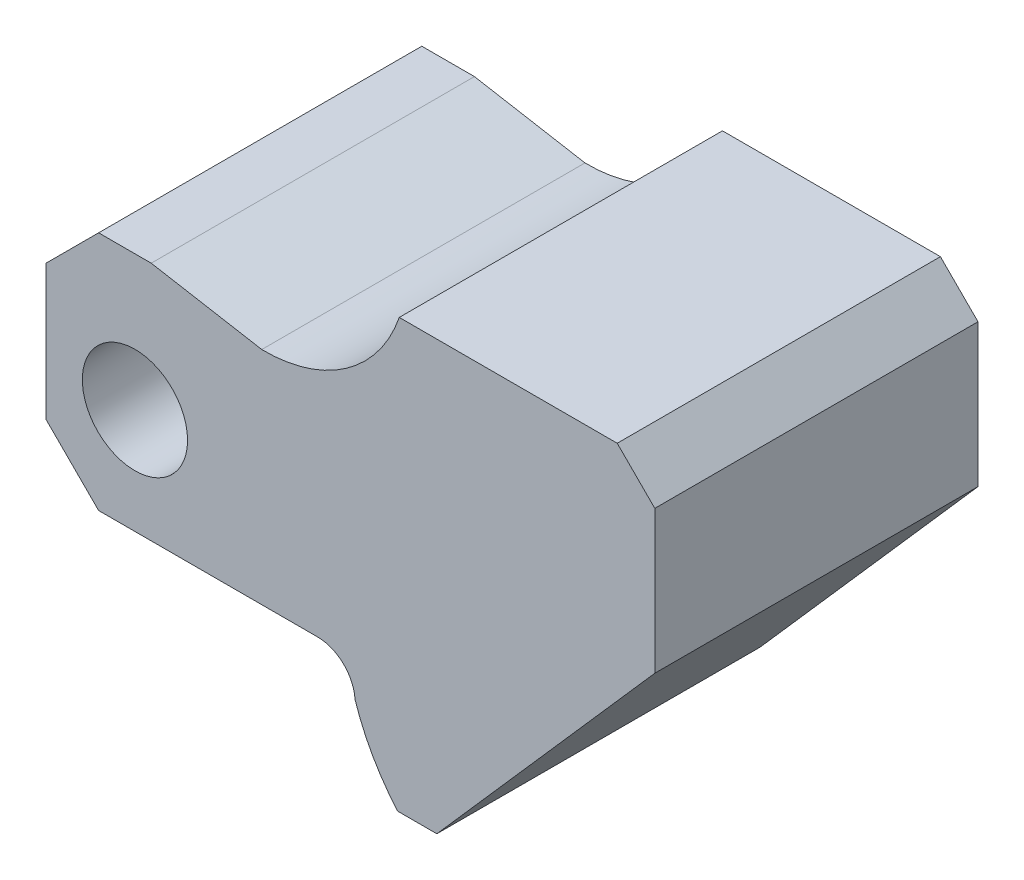
ISO-10303-21;
HEADER;
FILE_DESCRIPTION(('STEP AP214'),'2;1');
FILE_NAME('part.step','',(''),(''),'','','');
FILE_SCHEMA(('AUTOMOTIVE_DESIGN { 1 0 10303 214 1 1 1 1 }'));
ENDSEC;
DATA;
#1=APPLICATION_CONTEXT('core data for automotive mechanical design processes');
#2=APPLICATION_PROTOCOL_DEFINITION('international standard','automotive_design',2000,#1);
#3=PRODUCT_CONTEXT('',#1,'mechanical');
#4=PRODUCT('Part','Part','',(#3));
#5=PRODUCT_RELATED_PRODUCT_CATEGORY('part','',(#4));
#6=PRODUCT_DEFINITION_FORMATION('','',#4);
#7=PRODUCT_DEFINITION_CONTEXT('part definition',#1,'design');
#8=PRODUCT_DEFINITION('design','',#6,#7);
#9=PRODUCT_DEFINITION_SHAPE('','',#8);
#10=(LENGTH_UNIT() NAMED_UNIT(*) SI_UNIT(.MILLI.,.METRE.));
#11=(NAMED_UNIT(*) PLANE_ANGLE_UNIT() SI_UNIT($,.RADIAN.));
#12=(NAMED_UNIT(*) SI_UNIT($,.STERADIAN.) SOLID_ANGLE_UNIT());
#13=UNCERTAINTY_MEASURE_WITH_UNIT(LENGTH_MEASURE(1.E-05),#10,'distance_accuracy_value','');
#14=(GEOMETRIC_REPRESENTATION_CONTEXT(3) GLOBAL_UNCERTAINTY_ASSIGNED_CONTEXT((#13)) GLOBAL_UNIT_ASSIGNED_CONTEXT((#10,
#11,#12)) REPRESENTATION_CONTEXT('',''));
#15=CARTESIAN_POINT('',(0.,0.,0.));
#16=DIRECTION('',(0.,0.,1.));
#17=DIRECTION('',(1.,0.,0.));
#18=AXIS2_PLACEMENT_3D('',#15,#16,#17);
#19=CARTESIAN_POINT('',(24.0554988623099,7.3340290025084,43.));
#20=DIRECTION('',(0.707106781186548,0.707106781186547,0.));
#21=DIRECTION('',(-0.707106781186547,0.707106781186548,0.));
#22=AXIS2_PLACEMENT_3D('',#19,#20,#21);
#23=PLANE('',#22);
#24=DIRECTION('',(0.707106781186547,-0.707106781186548,0.));
#25=VECTOR('',#24,1.);
#26=CARTESIAN_POINT('',(24.0554988623099,7.3340290025084,0.));
#27=LINE('',#26,#25);
#28=CARTESIAN_POINT('',(24.0554988623099,7.3340290025084,0.));
#29=VERTEX_POINT('',#28);
#30=CARTESIAN_POINT('',(31.0554988623099,0.334029002508402,0.));
#31=VERTEX_POINT('',#30);
#32=EDGE_CURVE('E169',#29,#31,#27,.T.);
#33=ORIENTED_EDGE('',*,*,#32,.T.);
#34=DIRECTION('',(0.,0.,-1.));
#35=VECTOR('',#34,1.);
#36=CARTESIAN_POINT('',(31.0554988623099,0.334029002508402,43.));
#37=LINE('',#36,#35);
#38=CARTESIAN_POINT('',(31.0554988623099,0.334029002508402,43.));
#39=VERTEX_POINT('',#38);
#40=EDGE_CURVE('E11',#39,#31,#37,.T.);
#41=ORIENTED_EDGE('',*,*,#40,.F.);
#42=DIRECTION('',(0.707106781186547,-0.707106781186548,0.));
#43=VECTOR('',#42,1.);
#44=CARTESIAN_POINT('',(24.0554988623099,7.3340290025084,43.));
#45=LINE('',#44,#43);
#46=CARTESIAN_POINT('',(24.0554988623099,7.3340290025084,43.));
#47=VERTEX_POINT('',#46);
#48=EDGE_CURVE('E196',#47,#39,#45,.T.);
#49=ORIENTED_EDGE('',*,*,#48,.F.);
#50=DIRECTION('',(0.,0.,-1.));
#51=VECTOR('',#50,1.);
#52=CARTESIAN_POINT('',(24.0554988623099,7.3340290025084,43.));
#53=LINE('',#52,#51);
#54=EDGE_CURVE('E165',#47,#29,#53,.T.);
#55=ORIENTED_EDGE('',*,*,#54,.T.);
#56=EDGE_LOOP('',(#33,#41,#49,#55));
#57=FACE_BOUND('',#56,.T.);
#58=ADVANCED_FACE('F37',(#57),#23,.F.);
#59=CARTESIAN_POINT('',(31.0554988623099,0.334029002508402,43.));
#60=DIRECTION('',(0.,1.,0.));
#61=DIRECTION('',(0.,0.,1.));
#62=AXIS2_PLACEMENT_3D('',#59,#60,#61);
#63=PLANE('',#62);
#64=DIRECTION('',(1.,0.,0.));
#65=VECTOR('',#64,1.);
#66=CARTESIAN_POINT('',(31.0554988623099,0.334029002508402,0.));
#67=LINE('',#66,#65);
#68=CARTESIAN_POINT('',(60.1798444267935,0.334029002508401,0.));
#69=VERTEX_POINT('',#68);
#70=EDGE_CURVE('E172',#31,#69,#67,.T.);
#71=ORIENTED_EDGE('',*,*,#70,.T.);
#72=DIRECTION('',(0.,0.,-1.));
#73=VECTOR('',#72,1.);
#74=CARTESIAN_POINT('',(60.1798444267935,0.334029002508401,43.));
#75=LINE('',#74,#73);
#76=CARTESIAN_POINT('',(60.1798444267935,0.334029002508401,43.));
#77=VERTEX_POINT('',#76);
#78=EDGE_CURVE('E45',#77,#69,#75,.T.);
#79=ORIENTED_EDGE('',*,*,#78,.F.);
#80=DIRECTION('',(1.,0.,0.));
#81=VECTOR('',#80,1.);
#82=CARTESIAN_POINT('',(31.0554988623099,0.334029002508402,43.));
#83=LINE('',#82,#81);
#84=EDGE_CURVE('E114',#39,#77,#83,.T.);
#85=ORIENTED_EDGE('',*,*,#84,.F.);
#86=ORIENTED_EDGE('',*,*,#40,.T.);
#87=EDGE_LOOP('',(#71,#79,#85,#86));
#88=FACE_BOUND('',#87,.T.);
#89=ADVANCED_FACE('F285',(#88),#63,.F.);
#90=CARTESIAN_POINT('',(60.1798444267935,-4.6659709974916,43.));
#91=DIRECTION('',(0.,0.,-1.));
#92=DIRECTION('',(-1.,0.,0.));
#93=AXIS2_PLACEMENT_3D('',#90,#91,#92);
#94=CYLINDRICAL_SURFACE('',#93,5.);
#95=CARTESIAN_POINT('',(60.1798444267935,-4.6659709974916,0.));
#96=DIRECTION('',(0.,0.,-1.));
#97=DIRECTION('',(-1.,0.,0.));
#98=AXIS2_PLACEMENT_3D('',#95,#96,#97);
#99=CIRCLE('',#98,5.);
#100=CARTESIAN_POINT('',(65.1713210884327,-4.37414787244652,0.));
#101=VERTEX_POINT('',#100);
#102=EDGE_CURVE('E175',#69,#101,#99,.T.);
#103=ORIENTED_EDGE('',*,*,#102,.T.);
#104=DIRECTION('',(0.,0.,-1.));
#105=VECTOR('',#104,1.);
#106=CARTESIAN_POINT('',(65.1713210884327,-4.37414787244652,43.));
#107=LINE('',#106,#105);
#108=CARTESIAN_POINT('',(65.1713210884327,-4.37414787244652,43.));
#109=VERTEX_POINT('',#108);
#110=EDGE_CURVE('E221',#109,#101,#107,.T.);
#111=ORIENTED_EDGE('',*,*,#110,.F.);
#112=CARTESIAN_POINT('',(60.1798444267935,-4.6659709974916,43.));
#113=DIRECTION('',(0.,0.,-1.));
#114=DIRECTION('',(-1.,0.,0.));
#115=AXIS2_PLACEMENT_3D('',#112,#113,#114);
#116=CIRCLE('',#115,5.);
#117=EDGE_CURVE('E229',#77,#109,#116,.T.);
#118=ORIENTED_EDGE('',*,*,#117,.F.);
#119=ORIENTED_EDGE('',*,*,#78,.T.);
#120=EDGE_LOOP('',(#103,#111,#118,#119));
#121=FACE_BOUND('',#120,.T.);
#122=ADVANCED_FACE('F227',(#121),#94,.F.);
#123=CARTESIAN_POINT('',(92.7524685592796,4.58577981651377,43.));
#124=DIRECTION('',(0.,0.,-1.));
#125=DIRECTION('',(-1.,0.,0.));
#126=AXIS2_PLACEMENT_3D('',#123,#124,#125);
#127=CYLINDRICAL_SURFACE('',#126,29.);
#128=CARTESIAN_POINT('',(92.7524685592796,4.58577981651377,0.));
#129=DIRECTION('',(0.,0.,1.));
#130=DIRECTION('',(1.,0.,0.));
#131=AXIS2_PLACEMENT_3D('',#128,#129,#130);
#132=CIRCLE('',#131,29.);
#133=CARTESIAN_POINT('',(70.8435662590729,-14.4142201834862,0.));
#134=VERTEX_POINT('',#133);
#135=EDGE_CURVE('E177',#101,#134,#132,.T.);
#136=ORIENTED_EDGE('',*,*,#135,.T.);
#137=DIRECTION('',(0.,0.,-1.));
#138=VECTOR('',#137,1.);
#139=CARTESIAN_POINT('',(70.8435662590729,-14.4142201834862,43.));
#140=LINE('',#139,#138);
#141=CARTESIAN_POINT('',(70.8435662590729,-14.4142201834862,43.));
#142=VERTEX_POINT('',#141);
#143=EDGE_CURVE('E218',#142,#134,#140,.T.);
#144=ORIENTED_EDGE('',*,*,#143,.F.);
#145=CARTESIAN_POINT('',(92.7524685592796,4.58577981651377,43.));
#146=DIRECTION('',(0.,0.,1.));
#147=DIRECTION('',(1.,0.,0.));
#148=AXIS2_PLACEMENT_3D('',#145,#146,#147);
#149=CIRCLE('',#148,29.);
#150=EDGE_CURVE('E247',#109,#142,#149,.T.);
#151=ORIENTED_EDGE('',*,*,#150,.F.);
#152=ORIENTED_EDGE('',*,*,#110,.T.);
#153=EDGE_LOOP('',(#136,#144,#151,#152));
#154=FACE_BOUND('',#153,.T.);
#155=ADVANCED_FACE('F238',(#154),#127,.T.);
#156=CARTESIAN_POINT('',(76.0554988623099,-14.4142201834862,43.));
#157=DIRECTION('',(0.,1.,0.));
#158=DIRECTION('',(0.,0.,1.));
#159=AXIS2_PLACEMENT_3D('',#156,#157,#158);
#160=PLANE('',#159);
#161=DIRECTION('',(1.,0.,0.));
#162=VECTOR('',#161,1.);
#163=CARTESIAN_POINT('',(76.0554988623099,-14.4142201834862,0.));
#164=LINE('',#163,#162);
#165=CARTESIAN_POINT('',(76.0554988623099,-14.4142201834862,0.));
#166=VERTEX_POINT('',#165);
#167=EDGE_CURVE('E179',#134,#166,#164,.T.);
#168=ORIENTED_EDGE('',*,*,#167,.T.);
#169=DIRECTION('',(0.,0.,-1.));
#170=VECTOR('',#169,1.);
#171=CARTESIAN_POINT('',(76.0554988623099,-14.4142201834862,43.));
#172=LINE('',#171,#170);
#173=CARTESIAN_POINT('',(76.0554988623099,-14.4142201834862,43.));
#174=VERTEX_POINT('',#173);
#175=EDGE_CURVE('E215',#174,#166,#172,.T.);
#176=ORIENTED_EDGE('',*,*,#175,.F.);
#177=DIRECTION('',(1.,0.,0.));
#178=VECTOR('',#177,1.);
#179=CARTESIAN_POINT('',(76.0554988623099,-14.4142201834862,43.));
#180=LINE('',#179,#178);
#181=EDGE_CURVE('E244',#142,#174,#180,.T.);
#182=ORIENTED_EDGE('',*,*,#181,.F.);
#183=ORIENTED_EDGE('',*,*,#143,.T.);
#184=EDGE_LOOP('',(#168,#176,#182,#183));
#185=FACE_BOUND('',#184,.T.);
#186=ADVANCED_FACE('F242',(#185),#160,.F.);
#187=CARTESIAN_POINT('',(105.05549886231,18.5857798165138,43.));
#188=DIRECTION('',(-0.751164898449876,0.660114607728678,0.));
#189=DIRECTION('',(-0.660114607728678,-0.751164898449877,0.));
#190=AXIS2_PLACEMENT_3D('',#187,#188,#189);
#191=PLANE('',#190);
#192=DIRECTION('',(0.660114607728678,0.751164898449876,0.));
#193=VECTOR('',#192,1.);
#194=CARTESIAN_POINT('',(105.05549886231,18.5857798165138,0.));
#195=LINE('',#194,#193);
#196=CARTESIAN_POINT('',(105.05549886231,18.5857798165138,0.));
#197=VERTEX_POINT('',#196);
#198=EDGE_CURVE('E181',#166,#197,#195,.T.);
#199=ORIENTED_EDGE('',*,*,#198,.T.);
#200=DIRECTION('',(0.,0.,-1.));
#201=VECTOR('',#200,1.);
#202=CARTESIAN_POINT('',(105.05549886231,18.5857798165138,43.));
#203=LINE('',#202,#201);
#204=CARTESIAN_POINT('',(105.05549886231,18.5857798165138,43.));
#205=VERTEX_POINT('',#204);
#206=EDGE_CURVE('E212',#205,#197,#203,.T.);
#207=ORIENTED_EDGE('',*,*,#206,.F.);
#208=DIRECTION('',(0.660114607728678,0.751164898449876,0.));
#209=VECTOR('',#208,1.);
#210=CARTESIAN_POINT('',(105.05549886231,18.5857798165138,43.));
#211=LINE('',#210,#209);
#212=EDGE_CURVE('E246',#174,#205,#211,.T.);
#213=ORIENTED_EDGE('',*,*,#212,.F.);
#214=ORIENTED_EDGE('',*,*,#175,.T.);
#215=EDGE_LOOP('',(#199,#207,#213,#214));
#216=FACE_BOUND('',#215,.T.);
#217=ADVANCED_FACE('F298',(#216),#191,.F.);
#218=CARTESIAN_POINT('',(105.05549886231,37.5857798165138,43.));
#219=DIRECTION('',(-1.,0.,0.));
#220=DIRECTION('',(0.,-1.,0.));
#221=AXIS2_PLACEMENT_3D('',#218,#219,#220);
#222=PLANE('',#221);
#223=DIRECTION('',(0.,1.,0.));
#224=VECTOR('',#223,1.);
#225=CARTESIAN_POINT('',(105.05549886231,37.5857798165138,0.));
#226=LINE('',#225,#224);
#227=CARTESIAN_POINT('',(105.05549886231,37.5857798165138,0.));
#228=VERTEX_POINT('',#227);
#229=EDGE_CURVE('E183',#197,#228,#226,.T.);
#230=ORIENTED_EDGE('',*,*,#229,.T.);
#231=DIRECTION('',(0.,0.,-1.));
#232=VECTOR('',#231,1.);
#233=CARTESIAN_POINT('',(105.05549886231,37.5857798165138,43.));
#234=LINE('',#233,#232);
#235=CARTESIAN_POINT('',(105.05549886231,37.5857798165138,43.));
#236=VERTEX_POINT('',#235);
#237=EDGE_CURVE('E209',#236,#228,#234,.T.);
#238=ORIENTED_EDGE('',*,*,#237,.F.);
#239=DIRECTION('',(0.,1.,0.));
#240=VECTOR('',#239,1.);
#241=CARTESIAN_POINT('',(105.05549886231,37.5857798165138,43.));
#242=LINE('',#241,#240);
#243=EDGE_CURVE('E249',#205,#236,#242,.T.);
#244=ORIENTED_EDGE('',*,*,#243,.F.);
#245=ORIENTED_EDGE('',*,*,#206,.T.);
#246=EDGE_LOOP('',(#230,#238,#244,#245));
#247=FACE_BOUND('',#246,.T.);
#248=ADVANCED_FACE('F301',(#247),#222,.F.);
#249=CARTESIAN_POINT('',(100.05549886231,42.5857798165138,43.));
#250=DIRECTION('',(-0.707106781186544,-0.707106781186551,0.));
#251=DIRECTION('',(0.707106781186551,-0.707106781186544,0.));
#252=AXIS2_PLACEMENT_3D('',#249,#250,#251);
#253=PLANE('',#252);
#254=DIRECTION('',(-0.707106781186551,0.707106781186544,0.));
#255=VECTOR('',#254,1.);
#256=CARTESIAN_POINT('',(100.05549886231,42.5857798165138,0.));
#257=LINE('',#256,#255);
#258=CARTESIAN_POINT('',(100.05549886231,42.5857798165138,0.));
#259=VERTEX_POINT('',#258);
#260=EDGE_CURVE('E185',#228,#259,#257,.T.);
#261=ORIENTED_EDGE('',*,*,#260,.T.);
#262=DIRECTION('',(0.,0.,-1.));
#263=VECTOR('',#262,1.);
#264=CARTESIAN_POINT('',(100.05549886231,42.5857798165138,43.));
#265=LINE('',#264,#263);
#266=CARTESIAN_POINT('',(100.05549886231,42.5857798165138,43.));
#267=VERTEX_POINT('',#266);
#268=EDGE_CURVE('E206',#267,#259,#265,.T.);
#269=ORIENTED_EDGE('',*,*,#268,.F.);
#270=DIRECTION('',(-0.707106781186551,0.707106781186544,0.));
#271=VECTOR('',#270,1.);
#272=CARTESIAN_POINT('',(100.05549886231,42.5857798165138,43.));
#273=LINE('',#272,#271);
#274=EDGE_CURVE('E255',#236,#267,#273,.T.);
#275=ORIENTED_EDGE('',*,*,#274,.F.);
#276=ORIENTED_EDGE('',*,*,#237,.T.);
#277=EDGE_LOOP('',(#261,#269,#275,#276));
#278=FACE_BOUND('',#277,.T.);
#279=ADVANCED_FACE('F305',(#278),#253,.F.);
#280=CARTESIAN_POINT('',(71.0554988623098,42.5857798165138,43.));
#281=DIRECTION('',(0.,-1.,0.));
#282=DIRECTION('',(1.,0.,0.));
#283=AXIS2_PLACEMENT_3D('',#280,#281,#282);
#284=PLANE('',#283);
#285=DIRECTION('',(-1.,0.,0.));
#286=VECTOR('',#285,1.);
#287=CARTESIAN_POINT('',(71.0554988623098,42.5857798165138,0.));
#288=LINE('',#287,#286);
#289=CARTESIAN_POINT('',(71.0554988623098,42.5857798165138,0.));
#290=VERTEX_POINT('',#289);
#291=EDGE_CURVE('E187',#259,#290,#288,.T.);
#292=ORIENTED_EDGE('',*,*,#291,.T.);
#293=DIRECTION('',(0.,0.,-1.));
#294=VECTOR('',#293,1.);
#295=CARTESIAN_POINT('',(71.0554988623098,42.5857798165138,43.));
#296=LINE('',#295,#294);
#297=CARTESIAN_POINT('',(71.0554988623098,42.5857798165138,43.));
#298=VERTEX_POINT('',#297);
#299=EDGE_CURVE('E203',#298,#290,#296,.T.);
#300=ORIENTED_EDGE('',*,*,#299,.F.);
#301=DIRECTION('',(-1.,0.,0.));
#302=VECTOR('',#301,1.);
#303=CARTESIAN_POINT('',(71.0554988623098,42.5857798165138,43.));
#304=LINE('',#303,#302);
#305=EDGE_CURVE('E257',#267,#298,#304,.T.);
#306=ORIENTED_EDGE('',*,*,#305,.F.);
#307=ORIENTED_EDGE('',*,*,#268,.T.);
#308=EDGE_LOOP('',(#292,#300,#306,#307));
#309=FACE_BOUND('',#308,.T.);
#310=ADVANCED_FACE('F309',(#309),#284,.F.);
#311=CARTESIAN_POINT('',(53.0790310886532,48.737739372841,43.));
#312=DIRECTION('',(0.,0.,-1.));
#313=DIRECTION('',(-1.,0.,0.));
#314=AXIS2_PLACEMENT_3D('',#311,#312,#313);
#315=CYLINDRICAL_SURFACE('',#314,19.);
#316=CARTESIAN_POINT('',(53.0790310886532,48.737739372841,0.));
#317=DIRECTION('',(0.,0.,-1.));
#318=DIRECTION('',(-1.,0.,0.));
#319=AXIS2_PLACEMENT_3D('',#316,#317,#318);
#320=CIRCLE('',#319,19.);
#321=CARTESIAN_POINT('',(52.7650774955101,29.7403334146226,0.));
#322=VERTEX_POINT('',#321);
#323=EDGE_CURVE('E189',#290,#322,#320,.T.);
#324=ORIENTED_EDGE('',*,*,#323,.T.);
#325=DIRECTION('',(0.,0.,-1.));
#326=VECTOR('',#325,1.);
#327=CARTESIAN_POINT('',(52.7650774955101,29.7403334146226,43.));
#328=LINE('',#327,#326);
#329=CARTESIAN_POINT('',(52.7650774955101,29.7403334146226,43.));
#330=VERTEX_POINT('',#329);
#331=EDGE_CURVE('E200',#330,#322,#328,.T.);
#332=ORIENTED_EDGE('',*,*,#331,.F.);
#333=CARTESIAN_POINT('',(53.0790310886532,48.737739372841,43.));
#334=DIRECTION('',(0.,0.,-1.));
#335=DIRECTION('',(-1.,0.,0.));
#336=AXIS2_PLACEMENT_3D('',#333,#334,#335);
#337=CIRCLE('',#336,19.);
#338=EDGE_CURVE('E259',#298,#330,#337,.T.);
#339=ORIENTED_EDGE('',*,*,#338,.F.);
#340=ORIENTED_EDGE('',*,*,#299,.T.);
#341=EDGE_LOOP('',(#324,#332,#339,#340));
#342=FACE_BOUND('',#341,.T.);
#343=ADVANCED_FACE('F265',(#342),#315,.F.);
#344=CARTESIAN_POINT('',(38.0554988623099,32.3340290025084,43.));
#345=DIRECTION('',(-0.173648177666923,-0.984807753012209,0.));
#346=DIRECTION('',(0.984807753012209,-0.173648177666923,0.));
#347=AXIS2_PLACEMENT_3D('',#344,#345,#346);
#348=PLANE('',#347);
#349=DIRECTION('',(-0.984807753012209,0.173648177666923,0.));
#350=VECTOR('',#349,1.);
#351=CARTESIAN_POINT('',(38.0554988623099,32.3340290025084,0.));
#352=LINE('',#351,#350);
#353=CARTESIAN_POINT('',(38.0554988623099,32.3340290025084,0.));
#354=VERTEX_POINT('',#353);
#355=EDGE_CURVE('E191',#322,#354,#352,.T.);
#356=ORIENTED_EDGE('',*,*,#355,.T.);
#357=DIRECTION('',(0.,0.,-1.));
#358=VECTOR('',#357,1.);
#359=CARTESIAN_POINT('',(38.0554988623099,32.3340290025084,43.));
#360=LINE('',#359,#358);
#361=CARTESIAN_POINT('',(38.0554988623099,32.3340290025084,43.));
#362=VERTEX_POINT('',#361);
#363=EDGE_CURVE('E160',#362,#354,#360,.T.);
#364=ORIENTED_EDGE('',*,*,#363,.F.);
#365=DIRECTION('',(-0.984807753012209,0.173648177666923,0.));
#366=VECTOR('',#365,1.);
#367=CARTESIAN_POINT('',(38.0554988623099,32.3340290025084,43.));
#368=LINE('',#367,#366);
#369=EDGE_CURVE('E151',#330,#362,#368,.T.);
#370=ORIENTED_EDGE('',*,*,#369,.F.);
#371=ORIENTED_EDGE('',*,*,#331,.T.);
#372=EDGE_LOOP('',(#356,#364,#370,#371));
#373=FACE_BOUND('',#372,.T.);
#374=ADVANCED_FACE('F269',(#373),#348,.F.);
#375=CARTESIAN_POINT('',(38.0554988623099,32.3340290025084,43.));
#376=DIRECTION('',(0.,-1.,0.));
#377=DIRECTION('',(0.,0.,-1.));
#378=AXIS2_PLACEMENT_3D('',#375,#376,#377);
#379=PLANE('',#378);
#380=DIRECTION('',(-1.,0.,0.));
#381=VECTOR('',#380,1.);
#382=CARTESIAN_POINT('',(38.0554988623099,32.3340290025084,0.));
#383=LINE('',#382,#381);
#384=CARTESIAN_POINT('',(31.0554988623099,32.3340290025084,0.));
#385=VERTEX_POINT('',#384);
#386=EDGE_CURVE('E159',#354,#385,#383,.T.);
#387=ORIENTED_EDGE('',*,*,#386,.T.);
#388=DIRECTION('',(0.,0.,-1.));
#389=VECTOR('',#388,1.);
#390=CARTESIAN_POINT('',(31.0554988623099,32.3340290025084,43.));
#391=LINE('',#390,#389);
#392=CARTESIAN_POINT('',(31.0554988623099,32.3340290025084,43.));
#393=VERTEX_POINT('',#392);
#394=EDGE_CURVE('E156',#393,#385,#391,.T.);
#395=ORIENTED_EDGE('',*,*,#394,.F.);
#396=DIRECTION('',(-1.,0.,0.));
#397=VECTOR('',#396,1.);
#398=CARTESIAN_POINT('',(38.0554988623099,32.3340290025084,43.));
#399=LINE('',#398,#397);
#400=EDGE_CURVE('E145',#362,#393,#399,.T.);
#401=ORIENTED_EDGE('',*,*,#400,.F.);
#402=ORIENTED_EDGE('',*,*,#363,.T.);
#403=EDGE_LOOP('',(#387,#395,#401,#402));
#404=FACE_BOUND('',#403,.T.);
#405=ADVANCED_FACE('F157',(#404),#379,.F.);
#406=CARTESIAN_POINT('',(31.0554988623099,32.3340290025084,43.));
#407=DIRECTION('',(0.707106781186546,-0.707106781186549,0.));
#408=DIRECTION('',(0.707106781186549,0.707106781186546,0.));
#409=AXIS2_PLACEMENT_3D('',#406,#407,#408);
#410=PLANE('',#409);
#411=DIRECTION('',(-0.707106781186549,-0.707106781186546,0.));
#412=VECTOR('',#411,1.);
#413=CARTESIAN_POINT('',(31.0554988623099,32.3340290025084,0.));
#414=LINE('',#413,#412);
#415=CARTESIAN_POINT('',(24.0554988623099,25.3340290025084,0.));
#416=VERTEX_POINT('',#415);
#417=EDGE_CURVE('E100',#385,#416,#414,.T.);
#418=ORIENTED_EDGE('',*,*,#417,.T.);
#419=DIRECTION('',(0.,0.,-1.));
#420=VECTOR('',#419,1.);
#421=CARTESIAN_POINT('',(24.0554988623099,25.3340290025084,43.));
#422=LINE('',#421,#420);
#423=CARTESIAN_POINT('',(24.0554988623099,25.3340290025084,43.));
#424=VERTEX_POINT('',#423);
#425=EDGE_CURVE('E161',#424,#416,#422,.T.);
#426=ORIENTED_EDGE('',*,*,#425,.F.);
#427=DIRECTION('',(-0.707106781186549,-0.707106781186546,0.));
#428=VECTOR('',#427,1.);
#429=CARTESIAN_POINT('',(31.0554988623099,32.3340290025084,43.));
#430=LINE('',#429,#428);
#431=EDGE_CURVE('E149',#393,#424,#430,.T.);
#432=ORIENTED_EDGE('',*,*,#431,.F.);
#433=ORIENTED_EDGE('',*,*,#394,.T.);
#434=EDGE_LOOP('',(#418,#426,#432,#433));
#435=FACE_BOUND('',#434,.T.);
#436=ADVANCED_FACE('F163',(#435),#410,.F.);
#437=CARTESIAN_POINT('',(24.0554988623099,25.3340290025084,43.));
#438=DIRECTION('',(1.,0.,0.));
#439=DIRECTION('',(0.,1.,0.));
#440=AXIS2_PLACEMENT_3D('',#437,#438,#439);
#441=PLANE('',#440);
#442=DIRECTION('',(0.,-1.,0.));
#443=VECTOR('',#442,1.);
#444=CARTESIAN_POINT('',(24.0554988623099,25.3340290025084,0.));
#445=LINE('',#444,#443);
#446=EDGE_CURVE('E106',#416,#29,#445,.T.);
#447=ORIENTED_EDGE('',*,*,#446,.T.);
#448=ORIENTED_EDGE('',*,*,#54,.F.);
#449=DIRECTION('',(0.,-1.,0.));
#450=VECTOR('',#449,1.);
#451=CARTESIAN_POINT('',(24.0554988623099,25.3340290025084,43.));
#452=LINE('',#451,#450);
#453=EDGE_CURVE('E53',#424,#47,#452,.T.);
#454=ORIENTED_EDGE('',*,*,#453,.F.);
#455=ORIENTED_EDGE('',*,*,#425,.T.);
#456=EDGE_LOOP('',(#447,#448,#454,#455));
#457=FACE_BOUND('',#456,.T.);
#458=ADVANCED_FACE('F273',(#457),#441,.F.);
#459=CARTESIAN_POINT('',(60.1798444267935,-4.6659709974916,43.));
#460=DIRECTION('',(0.,0.,-1.));
#461=DIRECTION('',(-1.,0.,0.));
#462=AXIS2_PLACEMENT_3D('',#459,#460,#461);
#463=PLANE('',#462);
#464=CARTESIAN_POINT('',(35.8884613861278,14.3340290025084,43.));
#465=DIRECTION('',(0.,0.,1.));
#466=DIRECTION('',(1.,0.,0.));
#467=AXIS2_PLACEMENT_3D('',#464,#465,#466);
#468=CIRCLE('',#467,7.);
#469=CARTESIAN_POINT('',(42.8884613861278,14.3340290025084,43.));
#470=VERTEX_POINT('',#469);
#471=EDGE_CURVE('E364',#470,#470,#468,.T.);
#472=ORIENTED_EDGE('',*,*,#471,.F.);
#473=EDGE_LOOP('',(#472));
#474=FACE_BOUND('',#473,.T.);
#475=ORIENTED_EDGE('',*,*,#48,.T.);
#476=ORIENTED_EDGE('',*,*,#84,.T.);
#477=ORIENTED_EDGE('',*,*,#117,.T.);
#478=ORIENTED_EDGE('',*,*,#150,.T.);
#479=ORIENTED_EDGE('',*,*,#181,.T.);
#480=ORIENTED_EDGE('',*,*,#212,.T.);
#481=ORIENTED_EDGE('',*,*,#243,.T.);
#482=ORIENTED_EDGE('',*,*,#274,.T.);
#483=ORIENTED_EDGE('',*,*,#305,.T.);
#484=ORIENTED_EDGE('',*,*,#338,.T.);
#485=ORIENTED_EDGE('',*,*,#369,.T.);
#486=ORIENTED_EDGE('',*,*,#400,.T.);
#487=ORIENTED_EDGE('',*,*,#431,.T.);
#488=ORIENTED_EDGE('',*,*,#453,.T.);
#489=EDGE_LOOP('',(#475,#476,#477,#478,#479,#480,#481,#482,#483,#484,#485,#486,#487,#488));
#490=FACE_BOUND('',#489,.T.);
#491=ADVANCED_FACE('F147',(#474,#490),#463,.F.);
#492=CARTESIAN_POINT('',(60.1798444267935,-4.6659709974916,0.));
#493=DIRECTION('',(0.,0.,-1.));
#494=DIRECTION('',(-1.,0.,0.));
#495=AXIS2_PLACEMENT_3D('',#492,#493,#494);
#496=PLANE('',#495);
#497=CARTESIAN_POINT('',(35.8884613861278,14.3340290025084,0.));
#498=DIRECTION('',(0.,0.,1.));
#499=DIRECTION('',(1.,0.,0.));
#500=AXIS2_PLACEMENT_3D('',#497,#498,#499);
#501=CIRCLE('',#500,7.);
#502=CARTESIAN_POINT('',(42.8884613861278,14.3340290025084,0.));
#503=VERTEX_POINT('',#502);
#504=EDGE_CURVE('E173',#503,#503,#501,.T.);
#505=ORIENTED_EDGE('',*,*,#504,.T.);
#506=EDGE_LOOP('',(#505));
#507=FACE_BOUND('',#506,.T.);
#508=ORIENTED_EDGE('',*,*,#32,.F.);
#509=ORIENTED_EDGE('',*,*,#446,.F.);
#510=ORIENTED_EDGE('',*,*,#417,.F.);
#511=ORIENTED_EDGE('',*,*,#386,.F.);
#512=ORIENTED_EDGE('',*,*,#355,.F.);
#513=ORIENTED_EDGE('',*,*,#323,.F.);
#514=ORIENTED_EDGE('',*,*,#291,.F.);
#515=ORIENTED_EDGE('',*,*,#260,.F.);
#516=ORIENTED_EDGE('',*,*,#229,.F.);
#517=ORIENTED_EDGE('',*,*,#198,.F.);
#518=ORIENTED_EDGE('',*,*,#167,.F.);
#519=ORIENTED_EDGE('',*,*,#135,.F.);
#520=ORIENTED_EDGE('',*,*,#102,.F.);
#521=ORIENTED_EDGE('',*,*,#70,.F.);
#522=EDGE_LOOP('',(#508,#509,#510,#511,#512,#513,#514,#515,#516,#517,#518,#519,#520,#521));
#523=FACE_BOUND('',#522,.T.);
#524=ADVANCED_FACE('F233',(#507,#523),#496,.T.);
#525=CARTESIAN_POINT('',(35.8884613861278,14.3340290025084,0.));
#526=DIRECTION('',(0.,0.,1.));
#527=DIRECTION('',(1.,0.,0.));
#528=AXIS2_PLACEMENT_3D('',#525,#526,#527);
#529=CYLINDRICAL_SURFACE('',#528,7.);
#530=ORIENTED_EDGE('',*,*,#504,.F.);
#531=EDGE_LOOP('',(#530));
#532=FACE_BOUND('',#531,.T.);
#533=ORIENTED_EDGE('',*,*,#471,.T.);
#534=EDGE_LOOP('',(#533));
#535=FACE_BOUND('',#534,.T.);
#536=ADVANCED_FACE('F346',(#532,#535),#529,.F.);
#537=CLOSED_SHELL('',(#58,#89,#122,#155,#186,#217,#248,#279,#310,#343,#374,#405,#436,#458,#491,
#524,#536));
#538=MANIFOLD_SOLID_BREP('B2',#537);
#539=ADVANCED_BREP_SHAPE_REPRESENTATION('',(#18,#538),#14);
#540=SHAPE_DEFINITION_REPRESENTATION(#9,#539);
ENDSEC;
END-ISO-10303-21;
